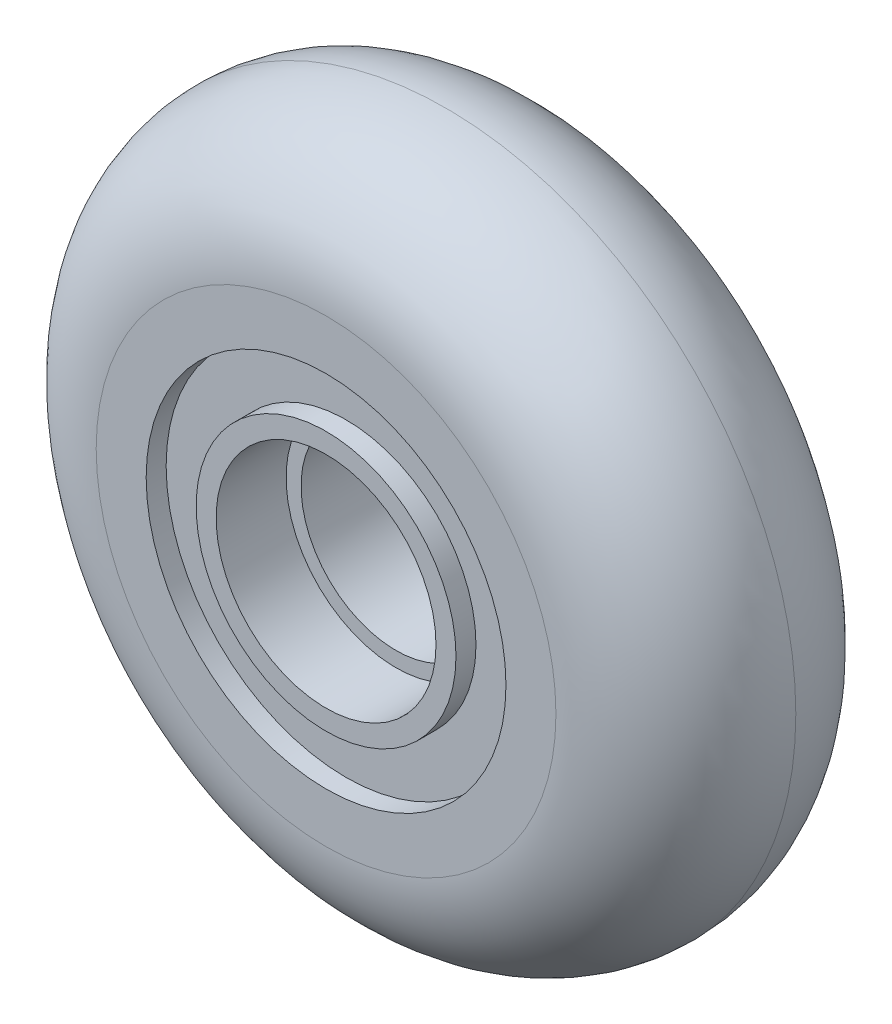
ISO-10303-21;
HEADER;
FILE_DESCRIPTION(('STEP AP214'),'2;1');
FILE_NAME('part.step','',(''),(''),'','','');
FILE_SCHEMA(('AUTOMOTIVE_DESIGN { 1 0 10303 214 1 1 1 1 }'));
ENDSEC;
DATA;
#1=APPLICATION_CONTEXT('core data for automotive mechanical design processes');
#2=APPLICATION_PROTOCOL_DEFINITION('international standard','automotive_design',2000,#1);
#3=PRODUCT_CONTEXT('',#1,'mechanical');
#4=PRODUCT('Part','Part','',(#3));
#5=PRODUCT_RELATED_PRODUCT_CATEGORY('part','',(#4));
#6=PRODUCT_DEFINITION_FORMATION('','',#4);
#7=PRODUCT_DEFINITION_CONTEXT('part definition',#1,'design');
#8=PRODUCT_DEFINITION('design','',#6,#7);
#9=PRODUCT_DEFINITION_SHAPE('','',#8);
#10=(LENGTH_UNIT() NAMED_UNIT(*) SI_UNIT(.MILLI.,.METRE.));
#11=(NAMED_UNIT(*) PLANE_ANGLE_UNIT() SI_UNIT($,.RADIAN.));
#12=(NAMED_UNIT(*) SI_UNIT($,.STERADIAN.) SOLID_ANGLE_UNIT());
#13=UNCERTAINTY_MEASURE_WITH_UNIT(LENGTH_MEASURE(1.E-05),#10,'distance_accuracy_value','');
#14=(GEOMETRIC_REPRESENTATION_CONTEXT(3) GLOBAL_UNCERTAINTY_ASSIGNED_CONTEXT((#13)) GLOBAL_UNIT_ASSIGNED_CONTEXT((#10,
#11,#12)) REPRESENTATION_CONTEXT('',''));
#15=CARTESIAN_POINT('',(0.,0.,0.));
#16=DIRECTION('',(0.,0.,1.));
#17=DIRECTION('',(1.,0.,0.));
#18=AXIS2_PLACEMENT_3D('',#15,#16,#17);
#19=CARTESIAN_POINT('',(0.,0.,24.));
#20=DIRECTION('',(0.,0.,1.));
#21=DIRECTION('',(1.,0.,0.));
#22=AXIS2_PLACEMENT_3D('',#19,#20,#21);
#23=PLANE('',#22);
#24=CARTESIAN_POINT('',(0.,0.,24.));
#25=DIRECTION('',(0.,0.,1.));
#26=DIRECTION('',(1.,0.,0.));
#27=AXIS2_PLACEMENT_3D('',#24,#25,#26);
#28=CIRCLE('',#27,11.);
#29=CARTESIAN_POINT('',(11.,0.,24.));
#30=VERTEX_POINT('',#29);
#31=EDGE_CURVE('E59',#30,#30,#28,.T.);
#32=ORIENTED_EDGE('',*,*,#31,.F.);
#33=EDGE_LOOP('',(#32));
#34=FACE_BOUND('',#33,.T.);
#35=CARTESIAN_POINT('',(0.,0.,24.));
#36=DIRECTION('',(0.,0.,1.));
#37=DIRECTION('',(1.,0.,0.));
#38=AXIS2_PLACEMENT_3D('',#35,#36,#37);
#39=CIRCLE('',#38,13.);
#40=CARTESIAN_POINT('',(13.,0.,24.));
#41=VERTEX_POINT('',#40);
#42=EDGE_CURVE('E92',#41,#41,#39,.T.);
#43=ORIENTED_EDGE('',*,*,#42,.T.);
#44=EDGE_LOOP('',(#43));
#45=FACE_BOUND('',#44,.T.);
#46=ADVANCED_FACE('F39',(#34,#45),#23,.T.);
#47=CARTESIAN_POINT('',(0.,0.,0.));
#48=DIRECTION('',(0.,0.,1.));
#49=DIRECTION('',(1.,0.,0.));
#50=AXIS2_PLACEMENT_3D('',#47,#48,#49);
#51=PLANE('',#50);
#52=CARTESIAN_POINT('',(0.,0.,0.));
#53=DIRECTION('',(0.,0.,-1.));
#54=DIRECTION('',(-1.,0.,0.));
#55=AXIS2_PLACEMENT_3D('',#52,#53,#54);
#56=CIRCLE('',#55,11.);
#57=CARTESIAN_POINT('',(-11.,0.,0.));
#58=VERTEX_POINT('',#57);
#59=EDGE_CURVE('E65',#58,#58,#56,.T.);
#60=ORIENTED_EDGE('',*,*,#59,.F.);
#61=EDGE_LOOP('',(#60));
#62=FACE_BOUND('',#61,.T.);
#63=CARTESIAN_POINT('',(0.,0.,0.));
#64=DIRECTION('',(0.,0.,-1.));
#65=DIRECTION('',(-1.,0.,0.));
#66=AXIS2_PLACEMENT_3D('',#63,#64,#65);
#67=CIRCLE('',#66,13.);
#68=CARTESIAN_POINT('',(-13.,0.,0.));
#69=VERTEX_POINT('',#68);
#70=EDGE_CURVE('E80',#69,#69,#67,.T.);
#71=ORIENTED_EDGE('',*,*,#70,.T.);
#72=EDGE_LOOP('',(#71));
#73=FACE_BOUND('',#72,.T.);
#74=ADVANCED_FACE('F109',(#62,#73),#51,.F.);
#75=CARTESIAN_POINT('',(0.,0.,24.));
#76=DIRECTION('',(0.,0.,1.));
#77=DIRECTION('',(1.,0.,0.));
#78=AXIS2_PLACEMENT_3D('',#75,#76,#77);
#79=CIRCLE('',#78,18.);
#80=CARTESIAN_POINT('',(18.,0.,24.));
#81=VERTEX_POINT('',#80);
#82=EDGE_CURVE('E86',#81,#81,#79,.T.);
#83=ORIENTED_EDGE('',*,*,#82,.F.);
#84=EDGE_LOOP('',(#83));
#85=FACE_BOUND('',#84,.T.);
#86=CARTESIAN_POINT('',(0.,0.,24.));
#87=DIRECTION('',(0.,0.,1.));
#88=DIRECTION('',(1.,0.,0.));
#89=AXIS2_PLACEMENT_3D('',#86,#87,#88);
#90=CIRCLE('',#89,23.);
#91=CARTESIAN_POINT('',(23.,0.,24.));
#92=VERTEX_POINT('',#91);
#93=EDGE_CURVE('E51',#92,#92,#90,.T.);
#94=ORIENTED_EDGE('',*,*,#93,.T.);
#95=EDGE_LOOP('',(#94));
#96=FACE_BOUND('',#95,.T.);
#97=ADVANCED_FACE('F41',(#85,#96),#23,.T.);
#98=CARTESIAN_POINT('',(0.,0.,0.));
#99=DIRECTION('',(0.,0.,-1.));
#100=DIRECTION('',(-1.,0.,0.));
#101=AXIS2_PLACEMENT_3D('',#98,#99,#100);
#102=CIRCLE('',#101,18.);
#103=CARTESIAN_POINT('',(-18.,0.,0.));
#104=VERTEX_POINT('',#103);
#105=EDGE_CURVE('E74',#104,#104,#102,.T.);
#106=ORIENTED_EDGE('',*,*,#105,.F.);
#107=EDGE_LOOP('',(#106));
#108=FACE_BOUND('',#107,.T.);
#109=CARTESIAN_POINT('',(0.,0.,0.));
#110=DIRECTION('',(0.,0.,1.));
#111=DIRECTION('',(1.,0.,0.));
#112=AXIS2_PLACEMENT_3D('',#109,#110,#111);
#113=CIRCLE('',#112,23.);
#114=CARTESIAN_POINT('',(23.,0.,0.));
#115=VERTEX_POINT('',#114);
#116=EDGE_CURVE('E11',#115,#115,#113,.F.);
#117=ORIENTED_EDGE('',*,*,#116,.T.);
#118=EDGE_LOOP('',(#117));
#119=FACE_BOUND('',#118,.T.);
#120=ADVANCED_FACE('F115',(#108,#119),#51,.F.);
#121=CARTESIAN_POINT('',(0.,0.,12.));
#122=DIRECTION('',(0.,0.,1.));
#123=DIRECTION('',(1.,0.,0.));
#124=AXIS2_PLACEMENT_3D('',#121,#122,#123);
#125=TOROIDAL_SURFACE('',#124,23.,12.);
#126=CARTESIAN_POINT('',(0.,0.,12.));
#127=DIRECTION('',(0.,0.,1.));
#128=DIRECTION('',(1.,0.,0.));
#129=AXIS2_PLACEMENT_3D('',#126,#127,#128);
#130=CIRCLE('',#129,35.);
#131=CARTESIAN_POINT('',(35.,0.,12.));
#132=VERTEX_POINT('',#131);
#133=EDGE_CURVE('E47',#132,#132,#130,.F.);
#134=ORIENTED_EDGE('',*,*,#133,.F.);
#135=EDGE_LOOP('',(#134));
#136=FACE_BOUND('',#135,.T.);
#137=ORIENTED_EDGE('',*,*,#93,.F.);
#138=EDGE_LOOP('',(#137));
#139=FACE_BOUND('',#138,.T.);
#140=ADVANCED_FACE('F122',(#136,#139),#125,.T.);
#141=CARTESIAN_POINT('',(0.,0.,12.));
#142=DIRECTION('',(0.,0.,1.));
#143=DIRECTION('',(1.,0.,0.));
#144=AXIS2_PLACEMENT_3D('',#141,#142,#143);
#145=TOROIDAL_SURFACE('',#144,23.,12.);
#146=ORIENTED_EDGE('',*,*,#116,.F.);
#147=EDGE_LOOP('',(#146));
#148=FACE_BOUND('',#147,.T.);
#149=ORIENTED_EDGE('',*,*,#133,.T.);
#150=EDGE_LOOP('',(#149));
#151=FACE_BOUND('',#150,.T.);
#152=ADVANCED_FACE('F129',(#148,#151),#145,.T.);
#153=CARTESIAN_POINT('',(0.,0.,17.));
#154=DIRECTION('',(0.,0.,1.));
#155=DIRECTION('',(1.,0.,0.));
#156=AXIS2_PLACEMENT_3D('',#153,#154,#155);
#157=CYLINDRICAL_SURFACE('',#156,11.);
#158=CARTESIAN_POINT('',(0.,0.,17.));
#159=DIRECTION('',(0.,0.,1.));
#160=DIRECTION('',(1.,0.,0.));
#161=AXIS2_PLACEMENT_3D('',#158,#159,#160);
#162=CIRCLE('',#161,11.);
#163=CARTESIAN_POINT('',(11.,0.,17.));
#164=VERTEX_POINT('',#163);
#165=EDGE_CURVE('E56',#164,#164,#162,.T.);
#166=ORIENTED_EDGE('',*,*,#165,.F.);
#167=EDGE_LOOP('',(#166));
#168=FACE_BOUND('',#167,.T.);
#169=ORIENTED_EDGE('',*,*,#31,.T.);
#170=EDGE_LOOP('',(#169));
#171=FACE_BOUND('',#170,.T.);
#172=ADVANCED_FACE('F135',(#168,#171),#157,.F.);
#173=CARTESIAN_POINT('',(0.,0.,17.));
#174=DIRECTION('',(0.,0.,1.));
#175=DIRECTION('',(1.,0.,0.));
#176=AXIS2_PLACEMENT_3D('',#173,#174,#175);
#177=PLANE('',#176);
#178=CARTESIAN_POINT('',(0.,0.,17.));
#179=DIRECTION('',(0.,0.,1.));
#180=DIRECTION('',(1.,0.,0.));
#181=AXIS2_PLACEMENT_3D('',#178,#179,#180);
#182=CIRCLE('',#181,9.5);
#183=CARTESIAN_POINT('',(9.5,0.,17.));
#184=VERTEX_POINT('',#183);
#185=EDGE_CURVE('E68',#184,#184,#182,.T.);
#186=ORIENTED_EDGE('',*,*,#185,.F.);
#187=EDGE_LOOP('',(#186));
#188=FACE_BOUND('',#187,.T.);
#189=ORIENTED_EDGE('',*,*,#165,.T.);
#190=EDGE_LOOP('',(#189));
#191=FACE_BOUND('',#190,.T.);
#192=ADVANCED_FACE('F142',(#188,#191),#177,.T.);
#193=CARTESIAN_POINT('',(0.,0.,7.));
#194=DIRECTION('',(0.,0.,-1.));
#195=DIRECTION('',(-1.,0.,0.));
#196=AXIS2_PLACEMENT_3D('',#193,#194,#195);
#197=CYLINDRICAL_SURFACE('',#196,11.);
#198=CARTESIAN_POINT('',(0.,0.,7.));
#199=DIRECTION('',(0.,0.,-1.));
#200=DIRECTION('',(-1.,0.,0.));
#201=AXIS2_PLACEMENT_3D('',#198,#199,#200);
#202=CIRCLE('',#201,11.);
#203=CARTESIAN_POINT('',(-11.,0.,7.));
#204=VERTEX_POINT('',#203);
#205=EDGE_CURVE('E62',#204,#204,#202,.T.);
#206=ORIENTED_EDGE('',*,*,#205,.F.);
#207=EDGE_LOOP('',(#206));
#208=FACE_BOUND('',#207,.T.);
#209=ORIENTED_EDGE('',*,*,#59,.T.);
#210=EDGE_LOOP('',(#209));
#211=FACE_BOUND('',#210,.T.);
#212=ADVANCED_FACE('F146',(#208,#211),#197,.F.);
#213=CARTESIAN_POINT('',(0.,0.,7.));
#214=DIRECTION('',(0.,0.,-1.));
#215=DIRECTION('',(-1.,0.,0.));
#216=AXIS2_PLACEMENT_3D('',#213,#214,#215);
#217=PLANE('',#216);
#218=CARTESIAN_POINT('',(0.,0.,7.));
#219=DIRECTION('',(0.,0.,-1.));
#220=DIRECTION('',(-1.,0.,0.));
#221=AXIS2_PLACEMENT_3D('',#218,#219,#220);
#222=CIRCLE('',#221,9.5);
#223=CARTESIAN_POINT('',(-9.5,0.,7.));
#224=VERTEX_POINT('',#223);
#225=EDGE_CURVE('E43',#224,#224,#222,.T.);
#226=ORIENTED_EDGE('',*,*,#225,.F.);
#227=EDGE_LOOP('',(#226));
#228=FACE_BOUND('',#227,.T.);
#229=ORIENTED_EDGE('',*,*,#205,.T.);
#230=EDGE_LOOP('',(#229));
#231=FACE_BOUND('',#230,.T.);
#232=ADVANCED_FACE('F150',(#228,#231),#217,.T.);
#233=CARTESIAN_POINT('',(0.,0.,0.));
#234=DIRECTION('',(0.,0.,1.));
#235=DIRECTION('',(1.,0.,0.));
#236=AXIS2_PLACEMENT_3D('',#233,#234,#235);
#237=CYLINDRICAL_SURFACE('',#236,9.5);
#238=ORIENTED_EDGE('',*,*,#225,.T.);
#239=EDGE_LOOP('',(#238));
#240=FACE_BOUND('',#239,.T.);
#241=ORIENTED_EDGE('',*,*,#185,.T.);
#242=EDGE_LOOP('',(#241));
#243=FACE_BOUND('',#242,.T.);
#244=ADVANCED_FACE('F154',(#240,#243),#237,.F.);
#245=CARTESIAN_POINT('',(0.,0.,2.));
#246=DIRECTION('',(0.,0.,-1.));
#247=DIRECTION('',(-1.,0.,0.));
#248=AXIS2_PLACEMENT_3D('',#245,#246,#247);
#249=CYLINDRICAL_SURFACE('',#248,18.);
#250=CARTESIAN_POINT('',(0.,0.,2.));
#251=DIRECTION('',(0.,0.,-1.));
#252=DIRECTION('',(-1.,0.,0.));
#253=AXIS2_PLACEMENT_3D('',#250,#251,#252);
#254=CIRCLE('',#253,18.);
#255=CARTESIAN_POINT('',(-18.,0.,2.));
#256=VERTEX_POINT('',#255);
#257=EDGE_CURVE('E71',#256,#256,#254,.T.);
#258=ORIENTED_EDGE('',*,*,#257,.F.);
#259=EDGE_LOOP('',(#258));
#260=FACE_BOUND('',#259,.T.);
#261=ORIENTED_EDGE('',*,*,#105,.T.);
#262=EDGE_LOOP('',(#261));
#263=FACE_BOUND('',#262,.T.);
#264=ADVANCED_FACE('F158',(#260,#263),#249,.F.);
#265=CARTESIAN_POINT('',(0.,0.,2.));
#266=DIRECTION('',(0.,0.,-1.));
#267=DIRECTION('',(-1.,0.,0.));
#268=AXIS2_PLACEMENT_3D('',#265,#266,#267);
#269=PLANE('',#268);
#270=CARTESIAN_POINT('',(0.,0.,2.));
#271=DIRECTION('',(0.,0.,-1.));
#272=DIRECTION('',(-1.,0.,0.));
#273=AXIS2_PLACEMENT_3D('',#270,#271,#272);
#274=CIRCLE('',#273,13.);
#275=CARTESIAN_POINT('',(-13.,0.,2.));
#276=VERTEX_POINT('',#275);
#277=EDGE_CURVE('E77',#276,#276,#274,.T.);
#278=ORIENTED_EDGE('',*,*,#277,.F.);
#279=EDGE_LOOP('',(#278));
#280=FACE_BOUND('',#279,.T.);
#281=ORIENTED_EDGE('',*,*,#257,.T.);
#282=EDGE_LOOP('',(#281));
#283=FACE_BOUND('',#282,.T.);
#284=ADVANCED_FACE('F162',(#280,#283),#269,.T.);
#285=CARTESIAN_POINT('',(0.,0.,2.));
#286=DIRECTION('',(0.,0.,-1.));
#287=DIRECTION('',(-1.,0.,0.));
#288=AXIS2_PLACEMENT_3D('',#285,#286,#287);
#289=CYLINDRICAL_SURFACE('',#288,13.);
#290=ORIENTED_EDGE('',*,*,#277,.T.);
#291=EDGE_LOOP('',(#290));
#292=FACE_BOUND('',#291,.T.);
#293=ORIENTED_EDGE('',*,*,#70,.F.);
#294=EDGE_LOOP('',(#293));
#295=FACE_BOUND('',#294,.T.);
#296=ADVANCED_FACE('F166',(#292,#295),#289,.T.);
#297=CARTESIAN_POINT('',(0.,0.,22.));
#298=DIRECTION('',(0.,0.,1.));
#299=DIRECTION('',(1.,0.,0.));
#300=AXIS2_PLACEMENT_3D('',#297,#298,#299);
#301=CYLINDRICAL_SURFACE('',#300,18.);
#302=CARTESIAN_POINT('',(0.,0.,22.));
#303=DIRECTION('',(0.,0.,1.));
#304=DIRECTION('',(1.,0.,0.));
#305=AXIS2_PLACEMENT_3D('',#302,#303,#304);
#306=CIRCLE('',#305,18.);
#307=CARTESIAN_POINT('',(18.,0.,22.));
#308=VERTEX_POINT('',#307);
#309=EDGE_CURVE('E83',#308,#308,#306,.T.);
#310=ORIENTED_EDGE('',*,*,#309,.F.);
#311=EDGE_LOOP('',(#310));
#312=FACE_BOUND('',#311,.T.);
#313=ORIENTED_EDGE('',*,*,#82,.T.);
#314=EDGE_LOOP('',(#313));
#315=FACE_BOUND('',#314,.T.);
#316=ADVANCED_FACE('F105',(#312,#315),#301,.F.);
#317=CARTESIAN_POINT('',(0.,0.,22.));
#318=DIRECTION('',(0.,0.,1.));
#319=DIRECTION('',(1.,0.,0.));
#320=AXIS2_PLACEMENT_3D('',#317,#318,#319);
#321=PLANE('',#320);
#322=CARTESIAN_POINT('',(0.,0.,22.));
#323=DIRECTION('',(0.,0.,1.));
#324=DIRECTION('',(1.,0.,0.));
#325=AXIS2_PLACEMENT_3D('',#322,#323,#324);
#326=CIRCLE('',#325,13.);
#327=CARTESIAN_POINT('',(13.,0.,22.));
#328=VERTEX_POINT('',#327);
#329=EDGE_CURVE('E89',#328,#328,#326,.T.);
#330=ORIENTED_EDGE('',*,*,#329,.F.);
#331=EDGE_LOOP('',(#330));
#332=FACE_BOUND('',#331,.T.);
#333=ORIENTED_EDGE('',*,*,#309,.T.);
#334=EDGE_LOOP('',(#333));
#335=FACE_BOUND('',#334,.T.);
#336=ADVANCED_FACE('F99',(#332,#335),#321,.T.);
#337=CARTESIAN_POINT('',(0.,0.,22.));
#338=DIRECTION('',(0.,0.,1.));
#339=DIRECTION('',(1.,0.,0.));
#340=AXIS2_PLACEMENT_3D('',#337,#338,#339);
#341=CYLINDRICAL_SURFACE('',#340,13.);
#342=ORIENTED_EDGE('',*,*,#329,.T.);
#343=EDGE_LOOP('',(#342));
#344=FACE_BOUND('',#343,.T.);
#345=ORIENTED_EDGE('',*,*,#42,.F.);
#346=EDGE_LOOP('',(#345));
#347=FACE_BOUND('',#346,.T.);
#348=ADVANCED_FACE('F97',(#344,#347),#341,.T.);
#349=CLOSED_SHELL('',(#46,#74,#97,#120,#140,#152,#172,#192,#212,#232,#244,#264,#284,#296,#316,
#336,#348));
#350=MANIFOLD_SOLID_BREP('B2',#349);
#351=ADVANCED_BREP_SHAPE_REPRESENTATION('',(#18,#350),#14);
#352=SHAPE_DEFINITION_REPRESENTATION(#9,#351);
ENDSEC;
END-ISO-10303-21;
